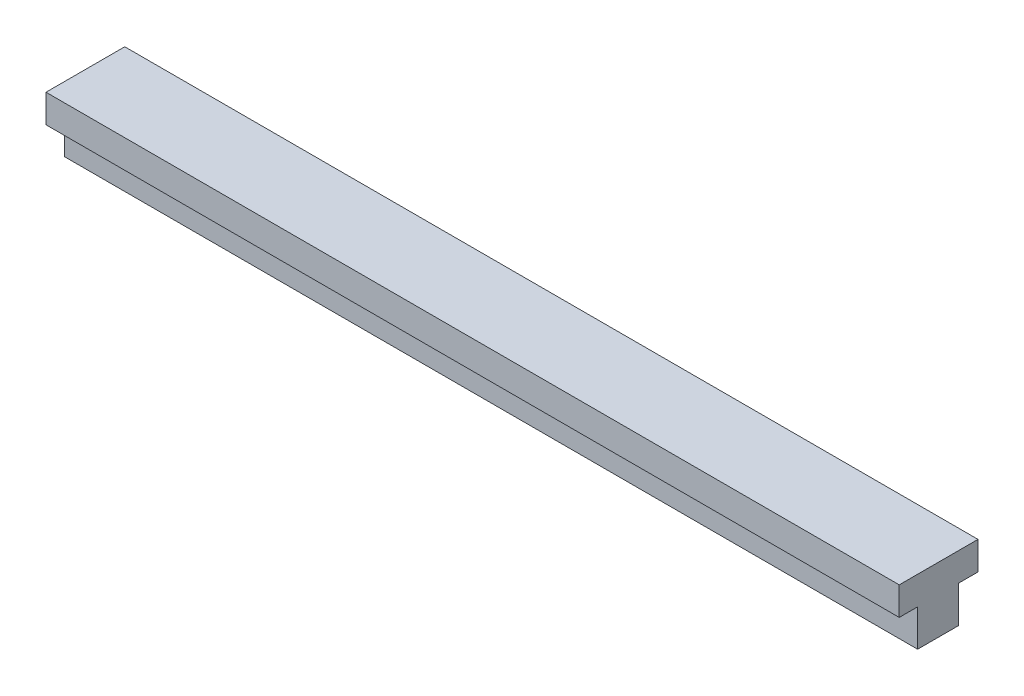
ISO-10303-21;
HEADER;
FILE_DESCRIPTION(('STEP AP214'),'2;1');
FILE_NAME('part.step','',(''),(''),'','','');
FILE_SCHEMA(('AUTOMOTIVE_DESIGN { 1 0 10303 214 1 1 1 1 }'));
ENDSEC;
DATA;
#1=APPLICATION_CONTEXT('core data for automotive mechanical design processes');
#2=APPLICATION_PROTOCOL_DEFINITION('international standard','automotive_design',2000,#1);
#3=PRODUCT_CONTEXT('',#1,'mechanical');
#4=PRODUCT('Part','Part','',(#3));
#5=PRODUCT_RELATED_PRODUCT_CATEGORY('part','',(#4));
#6=PRODUCT_DEFINITION_FORMATION('','',#4);
#7=PRODUCT_DEFINITION_CONTEXT('part definition',#1,'design');
#8=PRODUCT_DEFINITION('design','',#6,#7);
#9=PRODUCT_DEFINITION_SHAPE('','',#8);
#10=(LENGTH_UNIT() NAMED_UNIT(*) SI_UNIT(.MILLI.,.METRE.));
#11=(NAMED_UNIT(*) PLANE_ANGLE_UNIT() SI_UNIT($,.RADIAN.));
#12=(NAMED_UNIT(*) SI_UNIT($,.STERADIAN.) SOLID_ANGLE_UNIT());
#13=UNCERTAINTY_MEASURE_WITH_UNIT(LENGTH_MEASURE(1.E-05),#10,'distance_accuracy_value','');
#14=(GEOMETRIC_REPRESENTATION_CONTEXT(3) GLOBAL_UNCERTAINTY_ASSIGNED_CONTEXT((#13)) GLOBAL_UNIT_ASSIGNED_CONTEXT((#10,
#11,#12)) REPRESENTATION_CONTEXT('',''));
#15=CARTESIAN_POINT('',(0.,0.,0.));
#16=DIRECTION('',(0.,0.,1.));
#17=DIRECTION('',(1.,0.,0.));
#18=AXIS2_PLACEMENT_3D('',#15,#16,#17);
#19=CARTESIAN_POINT('',(-95.,-76.,26.0999));
#20=DIRECTION('',(0.,1.,0.));
#21=DIRECTION('',(-1.,0.,0.));
#22=AXIS2_PLACEMENT_3D('',#19,#20,#21);
#23=PLANE('',#22);
#24=DIRECTION('',(-1.,0.,0.));
#25=VECTOR('',#24,1.);
#26=CARTESIAN_POINT('',(35.,-76.,13.7));
#27=LINE('',#26,#25);
#28=CARTESIAN_POINT('',(35.,-76.,13.7));
#29=VERTEX_POINT('',#28);
#30=CARTESIAN_POINT('',(-95.,-76.,13.7));
#31=VERTEX_POINT('',#30);
#32=EDGE_CURVE('E11',#29,#31,#27,.T.);
#33=ORIENTED_EDGE('',*,*,#32,.T.);
#34=DIRECTION('',(0.,0.,1.));
#35=VECTOR('',#34,1.);
#36=CARTESIAN_POINT('',(-95.,-76.,10.));
#37=LINE('',#36,#35);
#38=CARTESIAN_POINT('',(-95.,-76.,7.5));
#39=VERTEX_POINT('',#38);
#40=EDGE_CURVE('E55',#39,#31,#37,.T.);
#41=ORIENTED_EDGE('',*,*,#40,.F.);
#42=DIRECTION('',(-1.,0.,0.));
#43=VECTOR('',#42,1.);
#44=CARTESIAN_POINT('',(35.,-76.,7.5));
#45=LINE('',#44,#43);
#46=CARTESIAN_POINT('',(35.,-76.,7.5));
#47=VERTEX_POINT('',#46);
#48=EDGE_CURVE('E147',#47,#39,#45,.T.);
#49=ORIENTED_EDGE('',*,*,#48,.F.);
#50=DIRECTION('',(0.,0.,-1.));
#51=VECTOR('',#50,1.);
#52=CARTESIAN_POINT('',(35.,-76.,0.));
#53=LINE('',#52,#51);
#54=EDGE_CURVE('E42',#29,#47,#53,.T.);
#55=ORIENTED_EDGE('',*,*,#54,.F.);
#56=EDGE_LOOP('',(#33,#41,#49,#55));
#57=FACE_BOUND('',#56,.T.);
#58=ADVANCED_FACE('F34',(#57),#23,.F.);
#59=CARTESIAN_POINT('',(35.,0.,4.5));
#60=DIRECTION('',(0.,0.,-1.));
#61=DIRECTION('',(-1.,0.,0.));
#62=AXIS2_PLACEMENT_3D('',#59,#60,#61);
#63=PLANE('',#62);
#64=DIRECTION('',(0.,-1.,0.));
#65=VECTOR('',#64,1.);
#66=CARTESIAN_POINT('',(-95.,0.,4.5));
#67=LINE('',#66,#65);
#68=CARTESIAN_POINT('',(-95.,-66.1,4.5));
#69=VERTEX_POINT('',#68);
#70=CARTESIAN_POINT('',(-95.,-70.4,4.5));
#71=VERTEX_POINT('',#70);
#72=EDGE_CURVE('E104',#69,#71,#67,.T.);
#73=ORIENTED_EDGE('',*,*,#72,.F.);
#74=DIRECTION('',(-1.,0.,0.));
#75=VECTOR('',#74,1.);
#76=CARTESIAN_POINT('',(35.,-66.1,4.5));
#77=LINE('',#76,#75);
#78=CARTESIAN_POINT('',(35.,-66.1,4.5));
#79=VERTEX_POINT('',#78);
#80=EDGE_CURVE('E99',#79,#69,#77,.T.);
#81=ORIENTED_EDGE('',*,*,#80,.F.);
#82=DIRECTION('',(0.,-1.,0.));
#83=VECTOR('',#82,1.);
#84=CARTESIAN_POINT('',(35.,0.,4.5));
#85=LINE('',#84,#83);
#86=CARTESIAN_POINT('',(35.,-70.4,4.5));
#87=VERTEX_POINT('',#86);
#88=EDGE_CURVE('E102',#79,#87,#85,.T.);
#89=ORIENTED_EDGE('',*,*,#88,.T.);
#90=DIRECTION('',(-1.,0.,0.));
#91=VECTOR('',#90,1.);
#92=CARTESIAN_POINT('',(35.,-70.4,4.5));
#93=LINE('',#92,#91);
#94=EDGE_CURVE('E109',#87,#71,#93,.T.);
#95=ORIENTED_EDGE('',*,*,#94,.T.);
#96=EDGE_LOOP('',(#73,#81,#89,#95));
#97=FACE_BOUND('',#96,.T.);
#98=ADVANCED_FACE('F101',(#97),#63,.T.);
#99=CARTESIAN_POINT('',(35.,-66.1,0.));
#100=DIRECTION('',(0.,1.,0.));
#101=DIRECTION('',(0.,0.,1.));
#102=AXIS2_PLACEMENT_3D('',#99,#100,#101);
#103=PLANE('',#102);
#104=DIRECTION('',(0.,0.,-1.));
#105=VECTOR('',#104,1.);
#106=CARTESIAN_POINT('',(-95.,-66.1,0.));
#107=LINE('',#106,#105);
#108=CARTESIAN_POINT('',(-95.,-66.1,16.5));
#109=VERTEX_POINT('',#108);
#110=EDGE_CURVE('E134',#109,#69,#107,.T.);
#111=ORIENTED_EDGE('',*,*,#110,.F.);
#112=DIRECTION('',(-1.,0.,0.));
#113=VECTOR('',#112,1.);
#114=CARTESIAN_POINT('',(35.,-66.1,16.5));
#115=LINE('',#114,#113);
#116=CARTESIAN_POINT('',(35.,-66.1,16.5));
#117=VERTEX_POINT('',#116);
#118=EDGE_CURVE('E123',#117,#109,#115,.T.);
#119=ORIENTED_EDGE('',*,*,#118,.F.);
#120=DIRECTION('',(0.,0.,-1.));
#121=VECTOR('',#120,1.);
#122=CARTESIAN_POINT('',(35.,-66.1,0.));
#123=LINE('',#122,#121);
#124=EDGE_CURVE('E116',#117,#79,#123,.T.);
#125=ORIENTED_EDGE('',*,*,#124,.T.);
#126=ORIENTED_EDGE('',*,*,#80,.T.);
#127=EDGE_LOOP('',(#111,#119,#125,#126));
#128=FACE_BOUND('',#127,.T.);
#129=ADVANCED_FACE('F122',(#128),#103,.T.);
#130=CARTESIAN_POINT('',(35.,0.,16.5));
#131=DIRECTION('',(0.,0.,-1.));
#132=DIRECTION('',(-1.,0.,0.));
#133=AXIS2_PLACEMENT_3D('',#130,#131,#132);
#134=PLANE('',#133);
#135=DIRECTION('',(0.,-1.,0.));
#136=VECTOR('',#135,1.);
#137=CARTESIAN_POINT('',(-95.,0.,16.5));
#138=LINE('',#137,#136);
#139=CARTESIAN_POINT('',(-95.,-70.4,16.5));
#140=VERTEX_POINT('',#139);
#141=EDGE_CURVE('E125',#109,#140,#138,.T.);
#142=ORIENTED_EDGE('',*,*,#141,.T.);
#143=DIRECTION('',(-1.,0.,0.));
#144=VECTOR('',#143,1.);
#145=CARTESIAN_POINT('',(35.,-70.4,16.5));
#146=LINE('',#145,#144);
#147=CARTESIAN_POINT('',(35.,-70.4,16.5));
#148=VERTEX_POINT('',#147);
#149=EDGE_CURVE('E142',#148,#140,#146,.T.);
#150=ORIENTED_EDGE('',*,*,#149,.F.);
#151=DIRECTION('',(0.,-1.,0.));
#152=VECTOR('',#151,1.);
#153=CARTESIAN_POINT('',(35.,0.,16.5));
#154=LINE('',#153,#152);
#155=EDGE_CURVE('E110',#117,#148,#154,.T.);
#156=ORIENTED_EDGE('',*,*,#155,.F.);
#157=ORIENTED_EDGE('',*,*,#118,.T.);
#158=EDGE_LOOP('',(#142,#150,#156,#157));
#159=FACE_BOUND('',#158,.T.);
#160=ADVANCED_FACE('F194',(#159),#134,.F.);
#161=CARTESIAN_POINT('',(35.,-70.4,0.));
#162=DIRECTION('',(0.,1.,0.));
#163=DIRECTION('',(0.,0.,1.));
#164=AXIS2_PLACEMENT_3D('',#161,#162,#163);
#165=PLANE('',#164);
#166=DIRECTION('',(0.,0.,-1.));
#167=VECTOR('',#166,1.);
#168=CARTESIAN_POINT('',(-95.,-70.4,0.));
#169=LINE('',#168,#167);
#170=CARTESIAN_POINT('',(-95.,-70.4,13.7));
#171=VERTEX_POINT('',#170);
#172=EDGE_CURVE('E127',#140,#171,#169,.T.);
#173=ORIENTED_EDGE('',*,*,#172,.T.);
#174=DIRECTION('',(-1.,0.,0.));
#175=VECTOR('',#174,1.);
#176=CARTESIAN_POINT('',(35.,-70.4,13.7));
#177=LINE('',#176,#175);
#178=CARTESIAN_POINT('',(35.,-70.4,13.7));
#179=VERTEX_POINT('',#178);
#180=EDGE_CURVE('E145',#179,#171,#177,.T.);
#181=ORIENTED_EDGE('',*,*,#180,.F.);
#182=DIRECTION('',(0.,0.,-1.));
#183=VECTOR('',#182,1.);
#184=CARTESIAN_POINT('',(35.,-70.4,0.));
#185=LINE('',#184,#183);
#186=EDGE_CURVE('E132',#148,#179,#185,.T.);
#187=ORIENTED_EDGE('',*,*,#186,.F.);
#188=ORIENTED_EDGE('',*,*,#149,.T.);
#189=EDGE_LOOP('',(#173,#181,#187,#188));
#190=FACE_BOUND('',#189,.T.);
#191=ADVANCED_FACE('F187',(#190),#165,.F.);
#192=CARTESIAN_POINT('',(35.,-150.,0.));
#193=DIRECTION('',(-1.,0.,0.));
#194=DIRECTION('',(0.,0.,1.));
#195=AXIS2_PLACEMENT_3D('',#192,#193,#194);
#196=PLANE('',#195);
#197=DIRECTION('',(0.,-1.,0.));
#198=VECTOR('',#197,1.);
#199=CARTESIAN_POINT('',(35.,0.,13.7));
#200=LINE('',#199,#198);
#201=EDGE_CURVE('E161',#179,#29,#200,.T.);
#202=ORIENTED_EDGE('',*,*,#201,.T.);
#203=ORIENTED_EDGE('',*,*,#54,.T.);
#204=DIRECTION('',(0.,-1.,0.));
#205=VECTOR('',#204,1.);
#206=CARTESIAN_POINT('',(35.,0.,7.49999999999999));
#207=LINE('',#206,#205);
#208=CARTESIAN_POINT('',(35.,-70.4,7.5));
#209=VERTEX_POINT('',#208);
#210=EDGE_CURVE('E131',#209,#47,#207,.T.);
#211=ORIENTED_EDGE('',*,*,#210,.F.);
#212=EDGE_CURVE('E119',#209,#87,#185,.T.);
#213=ORIENTED_EDGE('',*,*,#212,.T.);
#214=ORIENTED_EDGE('',*,*,#88,.F.);
#215=ORIENTED_EDGE('',*,*,#124,.F.);
#216=ORIENTED_EDGE('',*,*,#155,.T.);
#217=ORIENTED_EDGE('',*,*,#186,.T.);
#218=EDGE_LOOP('',(#202,#203,#211,#213,#214,#215,#216,#217));
#219=FACE_BOUND('',#218,.T.);
#220=ADVANCED_FACE('F115',(#219),#196,.F.);
#221=CARTESIAN_POINT('',(-95.,-70.4,7.5));
#222=VERTEX_POINT('',#221);
#223=EDGE_CURVE('E137',#222,#71,#169,.T.);
#224=ORIENTED_EDGE('',*,*,#223,.T.);
#225=ORIENTED_EDGE('',*,*,#94,.F.);
#226=ORIENTED_EDGE('',*,*,#212,.F.);
#227=DIRECTION('',(-1.,0.,0.));
#228=VECTOR('',#227,1.);
#229=CARTESIAN_POINT('',(35.,-70.4,7.5));
#230=LINE('',#229,#228);
#231=EDGE_CURVE('E152',#209,#222,#230,.T.);
#232=ORIENTED_EDGE('',*,*,#231,.T.);
#233=EDGE_LOOP('',(#224,#225,#226,#232));
#234=FACE_BOUND('',#233,.T.);
#235=ADVANCED_FACE('F178',(#234),#165,.F.);
#236=CARTESIAN_POINT('',(-95.,-40.,10.));
#237=DIRECTION('',(1.,0.,0.));
#238=DIRECTION('',(0.,0.,-1.));
#239=AXIS2_PLACEMENT_3D('',#236,#237,#238);
#240=PLANE('',#239);
#241=DIRECTION('',(0.,-1.,0.));
#242=VECTOR('',#241,1.);
#243=CARTESIAN_POINT('',(-95.,0.,7.49999999999999));
#244=LINE('',#243,#242);
#245=EDGE_CURVE('E139',#222,#39,#244,.T.);
#246=ORIENTED_EDGE('',*,*,#245,.T.);
#247=ORIENTED_EDGE('',*,*,#40,.T.);
#248=DIRECTION('',(0.,-1.,0.));
#249=VECTOR('',#248,1.);
#250=CARTESIAN_POINT('',(-95.,0.,13.7));
#251=LINE('',#250,#249);
#252=EDGE_CURVE('E165',#171,#31,#251,.T.);
#253=ORIENTED_EDGE('',*,*,#252,.F.);
#254=ORIENTED_EDGE('',*,*,#172,.F.);
#255=ORIENTED_EDGE('',*,*,#141,.F.);
#256=ORIENTED_EDGE('',*,*,#110,.T.);
#257=ORIENTED_EDGE('',*,*,#72,.T.);
#258=ORIENTED_EDGE('',*,*,#223,.F.);
#259=EDGE_LOOP('',(#246,#247,#253,#254,#255,#256,#257,#258));
#260=FACE_BOUND('',#259,.T.);
#261=ADVANCED_FACE('F191',(#260),#240,.F.);
#262=CARTESIAN_POINT('',(35.,0.,7.49999999999999));
#263=DIRECTION('',(0.,0.,-1.));
#264=DIRECTION('',(0.,1.,0.));
#265=AXIS2_PLACEMENT_3D('',#262,#263,#264);
#266=PLANE('',#265);
#267=ORIENTED_EDGE('',*,*,#245,.F.);
#268=ORIENTED_EDGE('',*,*,#231,.F.);
#269=ORIENTED_EDGE('',*,*,#210,.T.);
#270=ORIENTED_EDGE('',*,*,#48,.T.);
#271=EDGE_LOOP('',(#267,#268,#269,#270));
#272=FACE_BOUND('',#271,.T.);
#273=ADVANCED_FACE('F175',(#272),#266,.T.);
#274=CARTESIAN_POINT('',(35.,0.,13.7));
#275=DIRECTION('',(0.,0.,-1.));
#276=DIRECTION('',(0.,1.,0.));
#277=AXIS2_PLACEMENT_3D('',#274,#275,#276);
#278=PLANE('',#277);
#279=ORIENTED_EDGE('',*,*,#252,.T.);
#280=ORIENTED_EDGE('',*,*,#32,.F.);
#281=ORIENTED_EDGE('',*,*,#201,.F.);
#282=ORIENTED_EDGE('',*,*,#180,.T.);
#283=EDGE_LOOP('',(#279,#280,#281,#282));
#284=FACE_BOUND('',#283,.T.);
#285=ADVANCED_FACE('F190',(#284),#278,.F.);
#286=CLOSED_SHELL('',(#58,#98,#129,#160,#191,#220,#235,#261,#273,#285));
#287=MANIFOLD_SOLID_BREP('B2',#286);
#288=ADVANCED_BREP_SHAPE_REPRESENTATION('',(#18,#287),#14);
#289=SHAPE_DEFINITION_REPRESENTATION(#9,#288);
ENDSEC;
END-ISO-10303-21;
